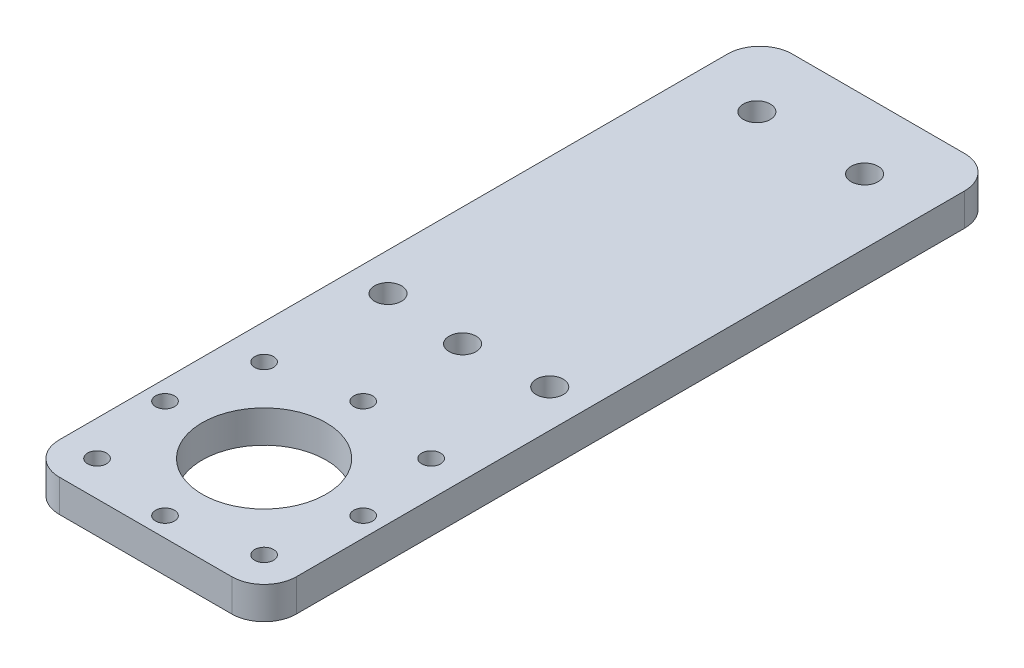
ISO-10303-21;
HEADER;
FILE_DESCRIPTION(('STEP AP214'),'2;1');
FILE_NAME('part.step','',(''),(''),'','','');
FILE_SCHEMA(('AUTOMOTIVE_DESIGN { 1 0 10303 214 1 1 1 1 }'));
ENDSEC;
DATA;
#1=APPLICATION_CONTEXT('core data for automotive mechanical design processes');
#2=APPLICATION_PROTOCOL_DEFINITION('international standard','automotive_design',2000,#1);
#3=PRODUCT_CONTEXT('',#1,'mechanical');
#4=PRODUCT('Part','Part','',(#3));
#5=PRODUCT_RELATED_PRODUCT_CATEGORY('part','',(#4));
#6=PRODUCT_DEFINITION_FORMATION('','',#4);
#7=PRODUCT_DEFINITION_CONTEXT('part definition',#1,'design');
#8=PRODUCT_DEFINITION('design','',#6,#7);
#9=PRODUCT_DEFINITION_SHAPE('','',#8);
#10=(LENGTH_UNIT() NAMED_UNIT(*) SI_UNIT(.MILLI.,.METRE.));
#11=(NAMED_UNIT(*) PLANE_ANGLE_UNIT() SI_UNIT($,.RADIAN.));
#12=(NAMED_UNIT(*) SI_UNIT($,.STERADIAN.) SOLID_ANGLE_UNIT());
#13=UNCERTAINTY_MEASURE_WITH_UNIT(LENGTH_MEASURE(1.E-05),#10,'distance_accuracy_value','');
#14=(GEOMETRIC_REPRESENTATION_CONTEXT(3) GLOBAL_UNCERTAINTY_ASSIGNED_CONTEXT((#13)) GLOBAL_UNIT_ASSIGNED_CONTEXT((#10,
#11,#12)) REPRESENTATION_CONTEXT('',''));
#15=CARTESIAN_POINT('',(0.,0.,0.));
#16=DIRECTION('',(0.,0.,1.));
#17=DIRECTION('',(1.,0.,0.));
#18=AXIS2_PLACEMENT_3D('',#15,#16,#17);
#19=CARTESIAN_POINT('',(0.,0.,0.));
#20=DIRECTION('',(0.,1.,0.));
#21=DIRECTION('',(0.,0.,1.));
#22=AXIS2_PLACEMENT_3D('',#19,#20,#21);
#23=PLANE('',#22);
#24=CARTESIAN_POINT('',(18.38477631085,0.,0.));
#25=DIRECTION('',(0.,-1.,0.));
#26=DIRECTION('',(0.,0.,-1.));
#27=AXIS2_PLACEMENT_3D('',#24,#25,#26);
#28=CIRCLE('',#27,1.75);
#29=CARTESIAN_POINT('',(18.38477631085,0.,-1.75));
#30=VERTEX_POINT('',#29);
#31=EDGE_CURVE('E215',#30,#30,#28,.F.);
#32=ORIENTED_EDGE('',*,*,#31,.T.);
#33=EDGE_LOOP('',(#32));
#34=FACE_BOUND('',#33,.T.);
#35=CARTESIAN_POINT('',(0.,0.,18.38477631085));
#36=DIRECTION('',(0.,-1.,0.));
#37=DIRECTION('',(0.,0.,-1.));
#38=AXIS2_PLACEMENT_3D('',#35,#36,#37);
#39=CIRCLE('',#38,1.75);
#40=CARTESIAN_POINT('',(0.,0.,16.63477631085));
#41=VERTEX_POINT('',#40);
#42=EDGE_CURVE('E219',#41,#41,#39,.F.);
#43=ORIENTED_EDGE('',*,*,#42,.T.);
#44=EDGE_LOOP('',(#43));
#45=FACE_BOUND('',#44,.T.);
#46=CARTESIAN_POINT('',(-18.38477631085,0.,0.));
#47=DIRECTION('',(0.,-1.,0.));
#48=DIRECTION('',(0.,0.,-1.));
#49=AXIS2_PLACEMENT_3D('',#46,#47,#48);
#50=CIRCLE('',#49,1.75);
#51=CARTESIAN_POINT('',(-18.38477631085,0.,-1.75));
#52=VERTEX_POINT('',#51);
#53=EDGE_CURVE('E223',#52,#52,#50,.F.);
#54=ORIENTED_EDGE('',*,*,#53,.T.);
#55=EDGE_LOOP('',(#54));
#56=FACE_BOUND('',#55,.T.);
#57=CARTESIAN_POINT('',(0.,0.,-18.38477631085));
#58=DIRECTION('',(0.,-1.,0.));
#59=DIRECTION('',(0.,0.,-1.));
#60=AXIS2_PLACEMENT_3D('',#57,#58,#59);
#61=CIRCLE('',#60,1.75);
#62=CARTESIAN_POINT('',(0.,0.,-20.13477631085));
#63=VERTEX_POINT('',#62);
#64=EDGE_CURVE('E227',#63,#63,#61,.F.);
#65=ORIENTED_EDGE('',*,*,#64,.T.);
#66=EDGE_LOOP('',(#65));
#67=FACE_BOUND('',#66,.T.);
#68=CARTESIAN_POINT('',(-15.5,0.,15.5));
#69=DIRECTION('',(0.,-1.,0.));
#70=DIRECTION('',(0.,0.,-1.));
#71=AXIS2_PLACEMENT_3D('',#68,#69,#70);
#72=CIRCLE('',#71,1.75);
#73=CARTESIAN_POINT('',(-15.5,0.,13.75));
#74=VERTEX_POINT('',#73);
#75=EDGE_CURVE('E231',#74,#74,#72,.F.);
#76=ORIENTED_EDGE('',*,*,#75,.T.);
#77=EDGE_LOOP('',(#76));
#78=FACE_BOUND('',#77,.T.);
#79=CARTESIAN_POINT('',(-15.5,0.,-15.5));
#80=DIRECTION('',(0.,-1.,0.));
#81=DIRECTION('',(0.,0.,-1.));
#82=AXIS2_PLACEMENT_3D('',#79,#80,#81);
#83=CIRCLE('',#82,1.75);
#84=CARTESIAN_POINT('',(-15.5,0.,-17.25));
#85=VERTEX_POINT('',#84);
#86=EDGE_CURVE('E235',#85,#85,#83,.F.);
#87=ORIENTED_EDGE('',*,*,#86,.T.);
#88=EDGE_LOOP('',(#87));
#89=FACE_BOUND('',#88,.T.);
#90=CARTESIAN_POINT('',(15.5,0.,-15.5));
#91=DIRECTION('',(0.,-1.,0.));
#92=DIRECTION('',(0.,0.,-1.));
#93=AXIS2_PLACEMENT_3D('',#90,#91,#92);
#94=CIRCLE('',#93,1.75);
#95=CARTESIAN_POINT('',(15.5,0.,-17.25));
#96=VERTEX_POINT('',#95);
#97=EDGE_CURVE('E239',#96,#96,#94,.F.);
#98=ORIENTED_EDGE('',*,*,#97,.T.);
#99=EDGE_LOOP('',(#98));
#100=FACE_BOUND('',#99,.T.);
#101=CARTESIAN_POINT('',(15.5,0.,15.5));
#102=DIRECTION('',(0.,-1.,0.));
#103=DIRECTION('',(0.,0.,-1.));
#104=AXIS2_PLACEMENT_3D('',#101,#102,#103);
#105=CIRCLE('',#104,1.75);
#106=CARTESIAN_POINT('',(15.5,0.,13.75));
#107=VERTEX_POINT('',#106);
#108=EDGE_CURVE('E243',#107,#107,#105,.F.);
#109=ORIENTED_EDGE('',*,*,#108,.T.);
#110=EDGE_LOOP('',(#109));
#111=FACE_BOUND('',#110,.T.);
#112=CARTESIAN_POINT('',(15.,0.,-38.));
#113=DIRECTION('',(0.,1.,0.));
#114=DIRECTION('',(0.,0.,1.));
#115=AXIS2_PLACEMENT_3D('',#112,#113,#114);
#116=CIRCLE('',#115,2.5);
#117=CARTESIAN_POINT('',(15.,0.,-35.5));
#118=VERTEX_POINT('',#117);
#119=EDGE_CURVE('E247',#118,#118,#116,.T.);
#120=ORIENTED_EDGE('',*,*,#119,.T.);
#121=EDGE_LOOP('',(#120));
#122=FACE_BOUND('',#121,.T.);
#123=CARTESIAN_POINT('',(-15.,0.,-38.));
#124=DIRECTION('',(0.,1.,0.));
#125=DIRECTION('',(0.,0.,1.));
#126=AXIS2_PLACEMENT_3D('',#123,#124,#125);
#127=CIRCLE('',#126,2.5);
#128=CARTESIAN_POINT('',(-15.,0.,-35.5));
#129=VERTEX_POINT('',#128);
#130=EDGE_CURVE('E251',#129,#129,#127,.T.);
#131=ORIENTED_EDGE('',*,*,#130,.T.);
#132=EDGE_LOOP('',(#131));
#133=FACE_BOUND('',#132,.T.);
#134=CARTESIAN_POINT('',(-10.,0.,-101.43));
#135=DIRECTION('',(0.,-1.,0.));
#136=DIRECTION('',(0.,0.,-1.));
#137=AXIS2_PLACEMENT_3D('',#134,#135,#136);
#138=CIRCLE('',#137,2.5);
#139=CARTESIAN_POINT('',(-10.,0.,-103.93));
#140=VERTEX_POINT('',#139);
#141=EDGE_CURVE('E255',#140,#140,#138,.F.);
#142=ORIENTED_EDGE('',*,*,#141,.T.);
#143=EDGE_LOOP('',(#142));
#144=FACE_BOUND('',#143,.T.);
#145=CARTESIAN_POINT('',(0.,0.,0.));
#146=DIRECTION('',(0.,-1.,0.));
#147=DIRECTION('',(0.,0.,-1.));
#148=AXIS2_PLACEMENT_3D('',#145,#146,#147);
#149=CIRCLE('',#148,11.5);
#150=CARTESIAN_POINT('',(0.,0.,-11.5));
#151=VERTEX_POINT('',#150);
#152=EDGE_CURVE('E259',#151,#151,#149,.F.);
#153=ORIENTED_EDGE('',*,*,#152,.T.);
#154=EDGE_LOOP('',(#153));
#155=FACE_BOUND('',#154,.T.);
#156=CARTESIAN_POINT('',(10.,0.,-101.43));
#157=DIRECTION('',(0.,-1.,0.));
#158=DIRECTION('',(0.,0.,-1.));
#159=AXIS2_PLACEMENT_3D('',#156,#157,#158);
#160=CIRCLE('',#159,2.5);
#161=CARTESIAN_POINT('',(10.,0.,-103.93));
#162=VERTEX_POINT('',#161);
#163=EDGE_CURVE('E263',#162,#162,#160,.F.);
#164=ORIENTED_EDGE('',*,*,#163,.T.);
#165=EDGE_LOOP('',(#164));
#166=FACE_BOUND('',#165,.T.);
#167=CARTESIAN_POINT('',(0.,0.,-36.83));
#168=DIRECTION('',(0.,-1.,0.));
#169=DIRECTION('',(0.,0.,-1.));
#170=AXIS2_PLACEMENT_3D('',#167,#168,#169);
#171=CIRCLE('',#170,2.5);
#172=CARTESIAN_POINT('',(0.,0.,-39.33));
#173=VERTEX_POINT('',#172);
#174=EDGE_CURVE('E267',#173,#173,#171,.F.);
#175=ORIENTED_EDGE('',*,*,#174,.T.);
#176=EDGE_LOOP('',(#175));
#177=FACE_BOUND('',#176,.T.);
#178=CARTESIAN_POINT('',(-16.,0.,16.));
#179=DIRECTION('',(0.,-1.,0.));
#180=DIRECTION('',(0.,0.,-1.));
#181=AXIS2_PLACEMENT_3D('',#178,#179,#180);
#182=CIRCLE('',#181,6.);
#183=CARTESIAN_POINT('',(-22.,0.,16.));
#184=VERTEX_POINT('',#183);
#185=CARTESIAN_POINT('',(-16.,0.,22.));
#186=VERTEX_POINT('',#185);
#187=EDGE_CURVE('E275',#184,#186,#182,.F.);
#188=ORIENTED_EDGE('',*,*,#187,.F.);
#189=DIRECTION('',(0.,0.,1.));
#190=VECTOR('',#189,1.);
#191=CARTESIAN_POINT('',(-22.,0.,-114.));
#192=LINE('',#191,#190);
#193=CARTESIAN_POINT('',(-22.,0.,-108.));
#194=VERTEX_POINT('',#193);
#195=EDGE_CURVE('E141',#194,#184,#192,.T.);
#196=ORIENTED_EDGE('',*,*,#195,.F.);
#197=CARTESIAN_POINT('',(-16.,0.,-108.));
#198=DIRECTION('',(0.,-1.,0.));
#199=DIRECTION('',(0.,0.,-1.));
#200=AXIS2_PLACEMENT_3D('',#197,#198,#199);
#201=CIRCLE('',#200,6.);
#202=CARTESIAN_POINT('',(-16.,0.,-114.));
#203=VERTEX_POINT('',#202);
#204=EDGE_CURVE('E106',#203,#194,#201,.F.);
#205=ORIENTED_EDGE('',*,*,#204,.F.);
#206=DIRECTION('',(-1.,0.,0.));
#207=VECTOR('',#206,1.);
#208=CARTESIAN_POINT('',(22.,0.,-114.));
#209=LINE('',#208,#207);
#210=CARTESIAN_POINT('',(16.,0.,-114.));
#211=VERTEX_POINT('',#210);
#212=EDGE_CURVE('E101',#211,#203,#209,.T.);
#213=ORIENTED_EDGE('',*,*,#212,.F.);
#214=CARTESIAN_POINT('',(16.,0.,-108.));
#215=DIRECTION('',(0.,-1.,0.));
#216=DIRECTION('',(0.,0.,-1.));
#217=AXIS2_PLACEMENT_3D('',#214,#215,#216);
#218=CIRCLE('',#217,6.);
#219=CARTESIAN_POINT('',(22.,0.,-108.));
#220=VERTEX_POINT('',#219);
#221=EDGE_CURVE('E20',#220,#211,#218,.F.);
#222=ORIENTED_EDGE('',*,*,#221,.F.);
#223=DIRECTION('',(0.,0.,-1.));
#224=VECTOR('',#223,1.);
#225=CARTESIAN_POINT('',(22.,0.,22.));
#226=LINE('',#225,#224);
#227=CARTESIAN_POINT('',(22.,0.,16.));
#228=VERTEX_POINT('',#227);
#229=EDGE_CURVE('E95',#228,#220,#226,.T.);
#230=ORIENTED_EDGE('',*,*,#229,.F.);
#231=CARTESIAN_POINT('',(16.,0.,16.));
#232=DIRECTION('',(0.,-1.,0.));
#233=DIRECTION('',(0.,0.,-1.));
#234=AXIS2_PLACEMENT_3D('',#231,#232,#233);
#235=CIRCLE('',#234,6.);
#236=CARTESIAN_POINT('',(16.,0.,22.));
#237=VERTEX_POINT('',#236);
#238=EDGE_CURVE('E271',#237,#228,#235,.F.);
#239=ORIENTED_EDGE('',*,*,#238,.F.);
#240=DIRECTION('',(1.,0.,0.));
#241=VECTOR('',#240,1.);
#242=CARTESIAN_POINT('',(-22.,0.,22.));
#243=LINE('',#242,#241);
#244=EDGE_CURVE('E134',#186,#237,#243,.T.);
#245=ORIENTED_EDGE('',*,*,#244,.F.);
#246=EDGE_LOOP('',(#188,#196,#205,#213,#222,#230,#239,#245));
#247=FACE_BOUND('',#246,.T.);
#248=ADVANCED_FACE('F17',(#34,#45,#56,#67,#78,#89,#100,#111,#122,#133,#144,#155,#166,#177,#247),
#23,.F.);
#249=CARTESIAN_POINT('',(22.,0.,22.));
#250=DIRECTION('',(1.,0.,0.));
#251=DIRECTION('',(0.,0.,-1.));
#252=AXIS2_PLACEMENT_3D('',#249,#250,#251);
#253=PLANE('',#252);
#254=DIRECTION('',(0.,0.,1.));
#255=VECTOR('',#254,1.);
#256=CARTESIAN_POINT('',(22.,6.,0.));
#257=LINE('',#256,#255);
#258=CARTESIAN_POINT('',(22.,6.,16.));
#259=VERTEX_POINT('',#258);
#260=CARTESIAN_POINT('',(22.,6.,-108.));
#261=VERTEX_POINT('',#260);
#262=EDGE_CURVE('E214',#259,#261,#257,.F.);
#263=ORIENTED_EDGE('',*,*,#262,.F.);
#264=DIRECTION('',(0.,-1.,0.));
#265=VECTOR('',#264,1.);
#266=CARTESIAN_POINT('',(22.,13.8216,16.));
#267=LINE('',#266,#265);
#268=EDGE_CURVE('E137',#228,#259,#267,.F.);
#269=ORIENTED_EDGE('',*,*,#268,.F.);
#270=ORIENTED_EDGE('',*,*,#229,.T.);
#271=DIRECTION('',(0.,-1.,0.));
#272=VECTOR('',#271,1.);
#273=CARTESIAN_POINT('',(22.,13.8216,-108.));
#274=LINE('',#273,#272);
#275=EDGE_CURVE('E117',#261,#220,#274,.T.);
#276=ORIENTED_EDGE('',*,*,#275,.F.);
#277=EDGE_LOOP('',(#263,#269,#270,#276));
#278=FACE_BOUND('',#277,.T.);
#279=ADVANCED_FACE('F314',(#278),#253,.T.);
#280=CARTESIAN_POINT('',(16.,13.8216,-108.));
#281=DIRECTION('',(0.,-1.,0.));
#282=DIRECTION('',(0.,0.,-1.));
#283=AXIS2_PLACEMENT_3D('',#280,#281,#282);
#284=CYLINDRICAL_SURFACE('',#283,6.);
#285=ORIENTED_EDGE('',*,*,#275,.T.);
#286=ORIENTED_EDGE('',*,*,#221,.T.);
#287=DIRECTION('',(0.,1.,0.));
#288=VECTOR('',#287,1.);
#289=CARTESIAN_POINT('',(16.,0.,-114.));
#290=LINE('',#289,#288);
#291=CARTESIAN_POINT('',(16.,6.,-114.));
#292=VERTEX_POINT('',#291);
#293=EDGE_CURVE('E111',#292,#211,#290,.F.);
#294=ORIENTED_EDGE('',*,*,#293,.F.);
#295=CARTESIAN_POINT('',(16.,6.,-108.));
#296=DIRECTION('',(0.,-1.,0.));
#297=DIRECTION('',(0.,0.,-1.));
#298=AXIS2_PLACEMENT_3D('',#295,#296,#297);
#299=CIRCLE('',#298,6.);
#300=EDGE_CURVE('E211',#261,#292,#299,.F.);
#301=ORIENTED_EDGE('',*,*,#300,.F.);
#302=EDGE_LOOP('',(#285,#286,#294,#301));
#303=FACE_BOUND('',#302,.T.);
#304=ADVANCED_FACE('F114',(#303),#284,.T.);
#305=CARTESIAN_POINT('',(22.,0.,-114.));
#306=DIRECTION('',(0.,0.,-1.));
#307=DIRECTION('',(-1.,0.,0.));
#308=AXIS2_PLACEMENT_3D('',#305,#306,#307);
#309=PLANE('',#308);
#310=DIRECTION('',(1.,0.,0.));
#311=VECTOR('',#310,1.);
#312=CARTESIAN_POINT('',(0.,6.,-114.));
#313=LINE('',#312,#311);
#314=CARTESIAN_POINT('',(-16.,6.,-114.));
#315=VERTEX_POINT('',#314);
#316=EDGE_CURVE('E121',#292,#315,#313,.F.);
#317=ORIENTED_EDGE('',*,*,#316,.F.);
#318=ORIENTED_EDGE('',*,*,#293,.T.);
#319=ORIENTED_EDGE('',*,*,#212,.T.);
#320=DIRECTION('',(0.,-1.,0.));
#321=VECTOR('',#320,1.);
#322=CARTESIAN_POINT('',(-16.,13.8216,-114.));
#323=LINE('',#322,#321);
#324=EDGE_CURVE('E124',#315,#203,#323,.T.);
#325=ORIENTED_EDGE('',*,*,#324,.F.);
#326=EDGE_LOOP('',(#317,#318,#319,#325));
#327=FACE_BOUND('',#326,.T.);
#328=ADVANCED_FACE('F119',(#327),#309,.T.);
#329=CARTESIAN_POINT('',(-16.,13.8216,-108.));
#330=DIRECTION('',(0.,-1.,0.));
#331=DIRECTION('',(0.,0.,-1.));
#332=AXIS2_PLACEMENT_3D('',#329,#330,#331);
#333=CYLINDRICAL_SURFACE('',#332,6.);
#334=ORIENTED_EDGE('',*,*,#324,.T.);
#335=ORIENTED_EDGE('',*,*,#204,.T.);
#336=DIRECTION('',(0.,1.,0.));
#337=VECTOR('',#336,1.);
#338=CARTESIAN_POINT('',(-22.,0.,-108.));
#339=LINE('',#338,#337);
#340=CARTESIAN_POINT('',(-22.,6.,-108.));
#341=VERTEX_POINT('',#340);
#342=EDGE_CURVE('E144',#341,#194,#339,.F.);
#343=ORIENTED_EDGE('',*,*,#342,.F.);
#344=CARTESIAN_POINT('',(-16.,6.,-108.));
#345=DIRECTION('',(0.,-1.,0.));
#346=DIRECTION('',(0.,0.,-1.));
#347=AXIS2_PLACEMENT_3D('',#344,#345,#346);
#348=CIRCLE('',#347,6.);
#349=EDGE_CURVE('E207',#315,#341,#348,.F.);
#350=ORIENTED_EDGE('',*,*,#349,.F.);
#351=EDGE_LOOP('',(#334,#335,#343,#350));
#352=FACE_BOUND('',#351,.T.);
#353=ADVANCED_FACE('F316',(#352),#333,.T.);
#354=CARTESIAN_POINT('',(-22.,0.,-114.));
#355=DIRECTION('',(-1.,0.,0.));
#356=DIRECTION('',(0.,0.,1.));
#357=AXIS2_PLACEMENT_3D('',#354,#355,#356);
#358=PLANE('',#357);
#359=ORIENTED_EDGE('',*,*,#195,.T.);
#360=DIRECTION('',(0.,-1.,0.));
#361=VECTOR('',#360,1.);
#362=CARTESIAN_POINT('',(-22.,13.8216,16.));
#363=LINE('',#362,#361);
#364=CARTESIAN_POINT('',(-22.,6.,16.));
#365=VERTEX_POINT('',#364);
#366=EDGE_CURVE('E143',#365,#184,#363,.T.);
#367=ORIENTED_EDGE('',*,*,#366,.F.);
#368=DIRECTION('',(0.,0.,1.));
#369=VECTOR('',#368,1.);
#370=CARTESIAN_POINT('',(-22.,6.,0.));
#371=LINE('',#370,#369);
#372=EDGE_CURVE('E206',#341,#365,#371,.T.);
#373=ORIENTED_EDGE('',*,*,#372,.F.);
#374=ORIENTED_EDGE('',*,*,#342,.T.);
#375=EDGE_LOOP('',(#359,#367,#373,#374));
#376=FACE_BOUND('',#375,.T.);
#377=ADVANCED_FACE('F317',(#376),#358,.T.);
#378=CARTESIAN_POINT('',(-16.,13.8216,16.));
#379=DIRECTION('',(0.,-1.,0.));
#380=DIRECTION('',(0.,0.,-1.));
#381=AXIS2_PLACEMENT_3D('',#378,#379,#380);
#382=CYLINDRICAL_SURFACE('',#381,6.);
#383=ORIENTED_EDGE('',*,*,#366,.T.);
#384=ORIENTED_EDGE('',*,*,#187,.T.);
#385=DIRECTION('',(0.,1.,0.));
#386=VECTOR('',#385,1.);
#387=CARTESIAN_POINT('',(-16.,0.,22.));
#388=LINE('',#387,#386);
#389=CARTESIAN_POINT('',(-16.,6.,22.));
#390=VERTEX_POINT('',#389);
#391=EDGE_CURVE('E138',#390,#186,#388,.F.);
#392=ORIENTED_EDGE('',*,*,#391,.F.);
#393=CARTESIAN_POINT('',(-16.,6.,16.));
#394=DIRECTION('',(0.,-1.,0.));
#395=DIRECTION('',(0.,0.,-1.));
#396=AXIS2_PLACEMENT_3D('',#393,#394,#395);
#397=CIRCLE('',#396,6.);
#398=EDGE_CURVE('E202',#365,#390,#397,.F.);
#399=ORIENTED_EDGE('',*,*,#398,.F.);
#400=EDGE_LOOP('',(#383,#384,#392,#399));
#401=FACE_BOUND('',#400,.T.);
#402=ADVANCED_FACE('F311',(#401),#382,.T.);
#403=CARTESIAN_POINT('',(-22.,0.,22.));
#404=DIRECTION('',(0.,0.,1.));
#405=DIRECTION('',(1.,0.,0.));
#406=AXIS2_PLACEMENT_3D('',#403,#404,#405);
#407=PLANE('',#406);
#408=ORIENTED_EDGE('',*,*,#244,.T.);
#409=DIRECTION('',(0.,-1.,0.));
#410=VECTOR('',#409,1.);
#411=CARTESIAN_POINT('',(16.,13.8216,22.));
#412=LINE('',#411,#410);
#413=CARTESIAN_POINT('',(16.,6.,22.));
#414=VERTEX_POINT('',#413);
#415=EDGE_CURVE('E40',#414,#237,#412,.T.);
#416=ORIENTED_EDGE('',*,*,#415,.F.);
#417=DIRECTION('',(1.,0.,0.));
#418=VECTOR('',#417,1.);
#419=CARTESIAN_POINT('',(0.,6.,22.));
#420=LINE('',#419,#418);
#421=EDGE_CURVE('E201',#390,#414,#420,.T.);
#422=ORIENTED_EDGE('',*,*,#421,.F.);
#423=ORIENTED_EDGE('',*,*,#391,.T.);
#424=EDGE_LOOP('',(#408,#416,#422,#423));
#425=FACE_BOUND('',#424,.T.);
#426=ADVANCED_FACE('F307',(#425),#407,.T.);
#427=CARTESIAN_POINT('',(16.,13.8216,16.));
#428=DIRECTION('',(0.,-1.,0.));
#429=DIRECTION('',(0.,0.,-1.));
#430=AXIS2_PLACEMENT_3D('',#427,#428,#429);
#431=CYLINDRICAL_SURFACE('',#430,6.);
#432=ORIENTED_EDGE('',*,*,#415,.T.);
#433=ORIENTED_EDGE('',*,*,#238,.T.);
#434=ORIENTED_EDGE('',*,*,#268,.T.);
#435=CARTESIAN_POINT('',(16.,6.,16.));
#436=DIRECTION('',(0.,-1.,0.));
#437=DIRECTION('',(0.,0.,-1.));
#438=AXIS2_PLACEMENT_3D('',#435,#436,#437);
#439=CIRCLE('',#438,6.);
#440=EDGE_CURVE('E197',#414,#259,#439,.F.);
#441=ORIENTED_EDGE('',*,*,#440,.F.);
#442=EDGE_LOOP('',(#432,#433,#434,#441));
#443=FACE_BOUND('',#442,.T.);
#444=ADVANCED_FACE('F313',(#443),#431,.T.);
#445=CARTESIAN_POINT('',(0.,6.,-36.83));
#446=DIRECTION('',(0.,-1.,0.));
#447=DIRECTION('',(0.,0.,-1.));
#448=AXIS2_PLACEMENT_3D('',#445,#446,#447);
#449=CYLINDRICAL_SURFACE('',#448,2.5);
#450=CARTESIAN_POINT('',(0.,6.,-36.83));
#451=DIRECTION('',(0.,-1.,0.));
#452=DIRECTION('',(0.,0.,-1.));
#453=AXIS2_PLACEMENT_3D('',#450,#451,#452);
#454=CIRCLE('',#453,2.5);
#455=CARTESIAN_POINT('',(0.,6.,-39.33));
#456=VERTEX_POINT('',#455);
#457=EDGE_CURVE('E193',#456,#456,#454,.T.);
#458=ORIENTED_EDGE('',*,*,#457,.F.);
#459=EDGE_LOOP('',(#458));
#460=FACE_BOUND('',#459,.T.);
#461=ORIENTED_EDGE('',*,*,#174,.F.);
#462=EDGE_LOOP('',(#461));
#463=FACE_BOUND('',#462,.T.);
#464=ADVANCED_FACE('F385',(#460,#463),#449,.F.);
#465=CARTESIAN_POINT('',(10.,6.,-101.43));
#466=DIRECTION('',(0.,-1.,0.));
#467=DIRECTION('',(0.,0.,-1.));
#468=AXIS2_PLACEMENT_3D('',#465,#466,#467);
#469=CYLINDRICAL_SURFACE('',#468,2.5);
#470=CARTESIAN_POINT('',(10.,6.,-101.43));
#471=DIRECTION('',(0.,-1.,0.));
#472=DIRECTION('',(0.,0.,-1.));
#473=AXIS2_PLACEMENT_3D('',#470,#471,#472);
#474=CIRCLE('',#473,2.5);
#475=CARTESIAN_POINT('',(10.,6.,-103.93));
#476=VERTEX_POINT('',#475);
#477=EDGE_CURVE('E189',#476,#476,#474,.T.);
#478=ORIENTED_EDGE('',*,*,#477,.F.);
#479=EDGE_LOOP('',(#478));
#480=FACE_BOUND('',#479,.T.);
#481=ORIENTED_EDGE('',*,*,#163,.F.);
#482=EDGE_LOOP('',(#481));
#483=FACE_BOUND('',#482,.T.);
#484=ADVANCED_FACE('F381',(#480,#483),#469,.F.);
#485=CARTESIAN_POINT('',(0.,6.,0.));
#486=DIRECTION('',(0.,-1.,0.));
#487=DIRECTION('',(0.,0.,-1.));
#488=AXIS2_PLACEMENT_3D('',#485,#486,#487);
#489=CYLINDRICAL_SURFACE('',#488,11.5);
#490=CARTESIAN_POINT('',(0.,6.,0.));
#491=DIRECTION('',(0.,-1.,0.));
#492=DIRECTION('',(0.,0.,-1.));
#493=AXIS2_PLACEMENT_3D('',#490,#491,#492);
#494=CIRCLE('',#493,11.5);
#495=CARTESIAN_POINT('',(0.,6.,-11.5));
#496=VERTEX_POINT('',#495);
#497=EDGE_CURVE('E185',#496,#496,#494,.T.);
#498=ORIENTED_EDGE('',*,*,#497,.F.);
#499=EDGE_LOOP('',(#498));
#500=FACE_BOUND('',#499,.T.);
#501=ORIENTED_EDGE('',*,*,#152,.F.);
#502=EDGE_LOOP('',(#501));
#503=FACE_BOUND('',#502,.T.);
#504=ADVANCED_FACE('F377',(#500,#503),#489,.F.);
#505=CARTESIAN_POINT('',(-10.,6.,-101.43));
#506=DIRECTION('',(0.,-1.,0.));
#507=DIRECTION('',(0.,0.,-1.));
#508=AXIS2_PLACEMENT_3D('',#505,#506,#507);
#509=CYLINDRICAL_SURFACE('',#508,2.5);
#510=CARTESIAN_POINT('',(-10.,6.,-101.43));
#511=DIRECTION('',(0.,-1.,0.));
#512=DIRECTION('',(0.,0.,-1.));
#513=AXIS2_PLACEMENT_3D('',#510,#511,#512);
#514=CIRCLE('',#513,2.5);
#515=CARTESIAN_POINT('',(-10.,6.,-103.93));
#516=VERTEX_POINT('',#515);
#517=EDGE_CURVE('E181',#516,#516,#514,.T.);
#518=ORIENTED_EDGE('',*,*,#517,.F.);
#519=EDGE_LOOP('',(#518));
#520=FACE_BOUND('',#519,.T.);
#521=ORIENTED_EDGE('',*,*,#141,.F.);
#522=EDGE_LOOP('',(#521));
#523=FACE_BOUND('',#522,.T.);
#524=ADVANCED_FACE('F373',(#520,#523),#509,.F.);
#525=CARTESIAN_POINT('',(-15.,0.,-38.));
#526=DIRECTION('',(0.,1.,0.));
#527=DIRECTION('',(0.,0.,1.));
#528=AXIS2_PLACEMENT_3D('',#525,#526,#527);
#529=CYLINDRICAL_SURFACE('',#528,2.5);
#530=CARTESIAN_POINT('',(-15.,6.,-38.));
#531=DIRECTION('',(0.,1.,0.));
#532=DIRECTION('',(0.,0.,1.));
#533=AXIS2_PLACEMENT_3D('',#530,#531,#532);
#534=CIRCLE('',#533,2.5);
#535=CARTESIAN_POINT('',(-15.,6.,-35.5));
#536=VERTEX_POINT('',#535);
#537=EDGE_CURVE('E177',#536,#536,#534,.F.);
#538=ORIENTED_EDGE('',*,*,#537,.F.);
#539=EDGE_LOOP('',(#538));
#540=FACE_BOUND('',#539,.T.);
#541=ORIENTED_EDGE('',*,*,#130,.F.);
#542=EDGE_LOOP('',(#541));
#543=FACE_BOUND('',#542,.T.);
#544=ADVANCED_FACE('F370',(#540,#543),#529,.F.);
#545=CARTESIAN_POINT('',(15.,0.,-38.));
#546=DIRECTION('',(0.,1.,0.));
#547=DIRECTION('',(0.,0.,1.));
#548=AXIS2_PLACEMENT_3D('',#545,#546,#547);
#549=CYLINDRICAL_SURFACE('',#548,2.5);
#550=CARTESIAN_POINT('',(15.,6.,-38.));
#551=DIRECTION('',(0.,1.,0.));
#552=DIRECTION('',(0.,0.,1.));
#553=AXIS2_PLACEMENT_3D('',#550,#551,#552);
#554=CIRCLE('',#553,2.5);
#555=CARTESIAN_POINT('',(15.,6.,-35.5));
#556=VERTEX_POINT('',#555);
#557=EDGE_CURVE('E173',#556,#556,#554,.F.);
#558=ORIENTED_EDGE('',*,*,#557,.F.);
#559=EDGE_LOOP('',(#558));
#560=FACE_BOUND('',#559,.T.);
#561=ORIENTED_EDGE('',*,*,#119,.F.);
#562=EDGE_LOOP('',(#561));
#563=FACE_BOUND('',#562,.T.);
#564=ADVANCED_FACE('F366',(#560,#563),#549,.F.);
#565=CARTESIAN_POINT('',(15.5,6.,15.5));
#566=DIRECTION('',(0.,-1.,0.));
#567=DIRECTION('',(0.,0.,-1.));
#568=AXIS2_PLACEMENT_3D('',#565,#566,#567);
#569=CYLINDRICAL_SURFACE('',#568,1.75);
#570=CARTESIAN_POINT('',(15.5,6.,15.5));
#571=DIRECTION('',(0.,-1.,0.));
#572=DIRECTION('',(0.,0.,-1.));
#573=AXIS2_PLACEMENT_3D('',#570,#571,#572);
#574=CIRCLE('',#573,1.75);
#575=CARTESIAN_POINT('',(15.5,6.,13.75));
#576=VERTEX_POINT('',#575);
#577=EDGE_CURVE('E169',#576,#576,#574,.T.);
#578=ORIENTED_EDGE('',*,*,#577,.F.);
#579=EDGE_LOOP('',(#578));
#580=FACE_BOUND('',#579,.T.);
#581=ORIENTED_EDGE('',*,*,#108,.F.);
#582=EDGE_LOOP('',(#581));
#583=FACE_BOUND('',#582,.T.);
#584=ADVANCED_FACE('F362',(#580,#583),#569,.F.);
#585=CARTESIAN_POINT('',(15.5,6.,-15.5));
#586=DIRECTION('',(0.,-1.,0.));
#587=DIRECTION('',(0.,0.,-1.));
#588=AXIS2_PLACEMENT_3D('',#585,#586,#587);
#589=CYLINDRICAL_SURFACE('',#588,1.75);
#590=CARTESIAN_POINT('',(15.5,6.,-15.5));
#591=DIRECTION('',(0.,-1.,0.));
#592=DIRECTION('',(0.,0.,-1.));
#593=AXIS2_PLACEMENT_3D('',#590,#591,#592);
#594=CIRCLE('',#593,1.75);
#595=CARTESIAN_POINT('',(15.5,6.,-17.25));
#596=VERTEX_POINT('',#595);
#597=EDGE_CURVE('E165',#596,#596,#594,.T.);
#598=ORIENTED_EDGE('',*,*,#597,.F.);
#599=EDGE_LOOP('',(#598));
#600=FACE_BOUND('',#599,.T.);
#601=ORIENTED_EDGE('',*,*,#97,.F.);
#602=EDGE_LOOP('',(#601));
#603=FACE_BOUND('',#602,.T.);
#604=ADVANCED_FACE('F358',(#600,#603),#589,.F.);
#605=CARTESIAN_POINT('',(-15.5,6.,-15.5));
#606=DIRECTION('',(0.,-1.,0.));
#607=DIRECTION('',(0.,0.,-1.));
#608=AXIS2_PLACEMENT_3D('',#605,#606,#607);
#609=CYLINDRICAL_SURFACE('',#608,1.75);
#610=CARTESIAN_POINT('',(-15.5,6.,-15.5));
#611=DIRECTION('',(0.,-1.,0.));
#612=DIRECTION('',(0.,0.,-1.));
#613=AXIS2_PLACEMENT_3D('',#610,#611,#612);
#614=CIRCLE('',#613,1.75);
#615=CARTESIAN_POINT('',(-15.5,6.,-17.25));
#616=VERTEX_POINT('',#615);
#617=EDGE_CURVE('E161',#616,#616,#614,.T.);
#618=ORIENTED_EDGE('',*,*,#617,.F.);
#619=EDGE_LOOP('',(#618));
#620=FACE_BOUND('',#619,.T.);
#621=ORIENTED_EDGE('',*,*,#86,.F.);
#622=EDGE_LOOP('',(#621));
#623=FACE_BOUND('',#622,.T.);
#624=ADVANCED_FACE('F354',(#620,#623),#609,.F.);
#625=CARTESIAN_POINT('',(-15.5,6.,15.5));
#626=DIRECTION('',(0.,-1.,0.));
#627=DIRECTION('',(0.,0.,-1.));
#628=AXIS2_PLACEMENT_3D('',#625,#626,#627);
#629=CYLINDRICAL_SURFACE('',#628,1.75);
#630=CARTESIAN_POINT('',(-15.5,6.,15.5));
#631=DIRECTION('',(0.,-1.,0.));
#632=DIRECTION('',(0.,0.,-1.));
#633=AXIS2_PLACEMENT_3D('',#630,#631,#632);
#634=CIRCLE('',#633,1.75);
#635=CARTESIAN_POINT('',(-15.5,6.,13.75));
#636=VERTEX_POINT('',#635);
#637=EDGE_CURVE('E157',#636,#636,#634,.T.);
#638=ORIENTED_EDGE('',*,*,#637,.F.);
#639=EDGE_LOOP('',(#638));
#640=FACE_BOUND('',#639,.T.);
#641=ORIENTED_EDGE('',*,*,#75,.F.);
#642=EDGE_LOOP('',(#641));
#643=FACE_BOUND('',#642,.T.);
#644=ADVANCED_FACE('F350',(#640,#643),#629,.F.);
#645=CARTESIAN_POINT('',(0.,6.,-18.38477631085));
#646=DIRECTION('',(0.,-1.,0.));
#647=DIRECTION('',(0.,0.,-1.));
#648=AXIS2_PLACEMENT_3D('',#645,#646,#647);
#649=CYLINDRICAL_SURFACE('',#648,1.75);
#650=CARTESIAN_POINT('',(0.,6.,-18.38477631085));
#651=DIRECTION('',(0.,-1.,0.));
#652=DIRECTION('',(0.,0.,-1.));
#653=AXIS2_PLACEMENT_3D('',#650,#651,#652);
#654=CIRCLE('',#653,1.75);
#655=CARTESIAN_POINT('',(0.,6.,-20.13477631085));
#656=VERTEX_POINT('',#655);
#657=EDGE_CURVE('E153',#656,#656,#654,.T.);
#658=ORIENTED_EDGE('',*,*,#657,.F.);
#659=EDGE_LOOP('',(#658));
#660=FACE_BOUND('',#659,.T.);
#661=ORIENTED_EDGE('',*,*,#64,.F.);
#662=EDGE_LOOP('',(#661));
#663=FACE_BOUND('',#662,.T.);
#664=ADVANCED_FACE('F346',(#660,#663),#649,.F.);
#665=CARTESIAN_POINT('',(-18.38477631085,6.,0.));
#666=DIRECTION('',(0.,-1.,0.));
#667=DIRECTION('',(0.,0.,-1.));
#668=AXIS2_PLACEMENT_3D('',#665,#666,#667);
#669=CYLINDRICAL_SURFACE('',#668,1.75);
#670=CARTESIAN_POINT('',(-18.38477631085,6.,0.));
#671=DIRECTION('',(0.,-1.,0.));
#672=DIRECTION('',(0.,0.,-1.));
#673=AXIS2_PLACEMENT_3D('',#670,#671,#672);
#674=CIRCLE('',#673,1.75);
#675=CARTESIAN_POINT('',(-18.38477631085,6.,-1.75));
#676=VERTEX_POINT('',#675);
#677=EDGE_CURVE('E149',#676,#676,#674,.T.);
#678=ORIENTED_EDGE('',*,*,#677,.F.);
#679=EDGE_LOOP('',(#678));
#680=FACE_BOUND('',#679,.T.);
#681=ORIENTED_EDGE('',*,*,#53,.F.);
#682=EDGE_LOOP('',(#681));
#683=FACE_BOUND('',#682,.T.);
#684=ADVANCED_FACE('F342',(#680,#683),#669,.F.);
#685=CARTESIAN_POINT('',(0.,6.,18.38477631085));
#686=DIRECTION('',(0.,-1.,0.));
#687=DIRECTION('',(0.,0.,-1.));
#688=AXIS2_PLACEMENT_3D('',#685,#686,#687);
#689=CYLINDRICAL_SURFACE('',#688,1.75);
#690=CARTESIAN_POINT('',(0.,6.,18.38477631085));
#691=DIRECTION('',(0.,-1.,0.));
#692=DIRECTION('',(0.,0.,-1.));
#693=AXIS2_PLACEMENT_3D('',#690,#691,#692);
#694=CIRCLE('',#693,1.75);
#695=CARTESIAN_POINT('',(0.,6.,16.63477631085));
#696=VERTEX_POINT('',#695);
#697=EDGE_CURVE('E27',#696,#696,#694,.T.);
#698=ORIENTED_EDGE('',*,*,#697,.F.);
#699=EDGE_LOOP('',(#698));
#700=FACE_BOUND('',#699,.T.);
#701=ORIENTED_EDGE('',*,*,#42,.F.);
#702=EDGE_LOOP('',(#701));
#703=FACE_BOUND('',#702,.T.);
#704=ADVANCED_FACE('F335',(#700,#703),#689,.F.);
#705=CARTESIAN_POINT('',(18.38477631085,6.,0.));
#706=DIRECTION('',(0.,-1.,0.));
#707=DIRECTION('',(0.,0.,-1.));
#708=AXIS2_PLACEMENT_3D('',#705,#706,#707);
#709=CYLINDRICAL_SURFACE('',#708,1.75);
#710=CARTESIAN_POINT('',(18.38477631085,6.,0.));
#711=DIRECTION('',(0.,-1.,0.));
#712=DIRECTION('',(0.,0.,-1.));
#713=AXIS2_PLACEMENT_3D('',#710,#711,#712);
#714=CIRCLE('',#713,1.75);
#715=CARTESIAN_POINT('',(18.38477631085,6.,-1.75));
#716=VERTEX_POINT('',#715);
#717=EDGE_CURVE('E11',#716,#716,#714,.T.);
#718=ORIENTED_EDGE('',*,*,#717,.F.);
#719=EDGE_LOOP('',(#718));
#720=FACE_BOUND('',#719,.T.);
#721=ORIENTED_EDGE('',*,*,#31,.F.);
#722=EDGE_LOOP('',(#721));
#723=FACE_BOUND('',#722,.T.);
#724=ADVANCED_FACE('F329',(#720,#723),#709,.F.);
#725=CARTESIAN_POINT('',(0.,6.,0.));
#726=DIRECTION('',(0.,1.,0.));
#727=DIRECTION('',(0.,0.,1.));
#728=AXIS2_PLACEMENT_3D('',#725,#726,#727);
#729=PLANE('',#728);
#730=ORIENTED_EDGE('',*,*,#717,.T.);
#731=EDGE_LOOP('',(#730));
#732=FACE_BOUND('',#731,.T.);
#733=ORIENTED_EDGE('',*,*,#697,.T.);
#734=EDGE_LOOP('',(#733));
#735=FACE_BOUND('',#734,.T.);
#736=ORIENTED_EDGE('',*,*,#677,.T.);
#737=EDGE_LOOP('',(#736));
#738=FACE_BOUND('',#737,.T.);
#739=ORIENTED_EDGE('',*,*,#657,.T.);
#740=EDGE_LOOP('',(#739));
#741=FACE_BOUND('',#740,.T.);
#742=ORIENTED_EDGE('',*,*,#637,.T.);
#743=EDGE_LOOP('',(#742));
#744=FACE_BOUND('',#743,.T.);
#745=ORIENTED_EDGE('',*,*,#617,.T.);
#746=EDGE_LOOP('',(#745));
#747=FACE_BOUND('',#746,.T.);
#748=ORIENTED_EDGE('',*,*,#597,.T.);
#749=EDGE_LOOP('',(#748));
#750=FACE_BOUND('',#749,.T.);
#751=ORIENTED_EDGE('',*,*,#577,.T.);
#752=EDGE_LOOP('',(#751));
#753=FACE_BOUND('',#752,.T.);
#754=ORIENTED_EDGE('',*,*,#557,.T.);
#755=EDGE_LOOP('',(#754));
#756=FACE_BOUND('',#755,.T.);
#757=ORIENTED_EDGE('',*,*,#537,.T.);
#758=EDGE_LOOP('',(#757));
#759=FACE_BOUND('',#758,.T.);
#760=ORIENTED_EDGE('',*,*,#517,.T.);
#761=EDGE_LOOP('',(#760));
#762=FACE_BOUND('',#761,.T.);
#763=ORIENTED_EDGE('',*,*,#497,.T.);
#764=EDGE_LOOP('',(#763));
#765=FACE_BOUND('',#764,.T.);
#766=ORIENTED_EDGE('',*,*,#477,.T.);
#767=EDGE_LOOP('',(#766));
#768=FACE_BOUND('',#767,.T.);
#769=ORIENTED_EDGE('',*,*,#457,.T.);
#770=EDGE_LOOP('',(#769));
#771=FACE_BOUND('',#770,.T.);
#772=ORIENTED_EDGE('',*,*,#421,.T.);
#773=ORIENTED_EDGE('',*,*,#440,.T.);
#774=ORIENTED_EDGE('',*,*,#262,.T.);
#775=ORIENTED_EDGE('',*,*,#300,.T.);
#776=ORIENTED_EDGE('',*,*,#316,.T.);
#777=ORIENTED_EDGE('',*,*,#349,.T.);
#778=ORIENTED_EDGE('',*,*,#372,.T.);
#779=ORIENTED_EDGE('',*,*,#398,.T.);
#780=EDGE_LOOP('',(#772,#773,#774,#775,#776,#777,#778,#779));
#781=FACE_BOUND('',#780,.T.);
#782=ADVANCED_FACE('F305',(#732,#735,#738,#741,#744,#747,#750,#753,#756,#759,#762,#765,#768,
#771,#781),#729,.T.);
#783=CLOSED_SHELL('',(#248,#279,#304,#328,#353,#377,#402,#426,#444,#464,#484,#504,#524,#544,
#564,#584,#604,#624,#644,#664,#684,#704,#724,#782));
#784=MANIFOLD_SOLID_BREP('B1',#783);
#785=ADVANCED_BREP_SHAPE_REPRESENTATION('',(#18,#784),#14);
#786=SHAPE_DEFINITION_REPRESENTATION(#9,#785);
ENDSEC;
END-ISO-10303-21;
